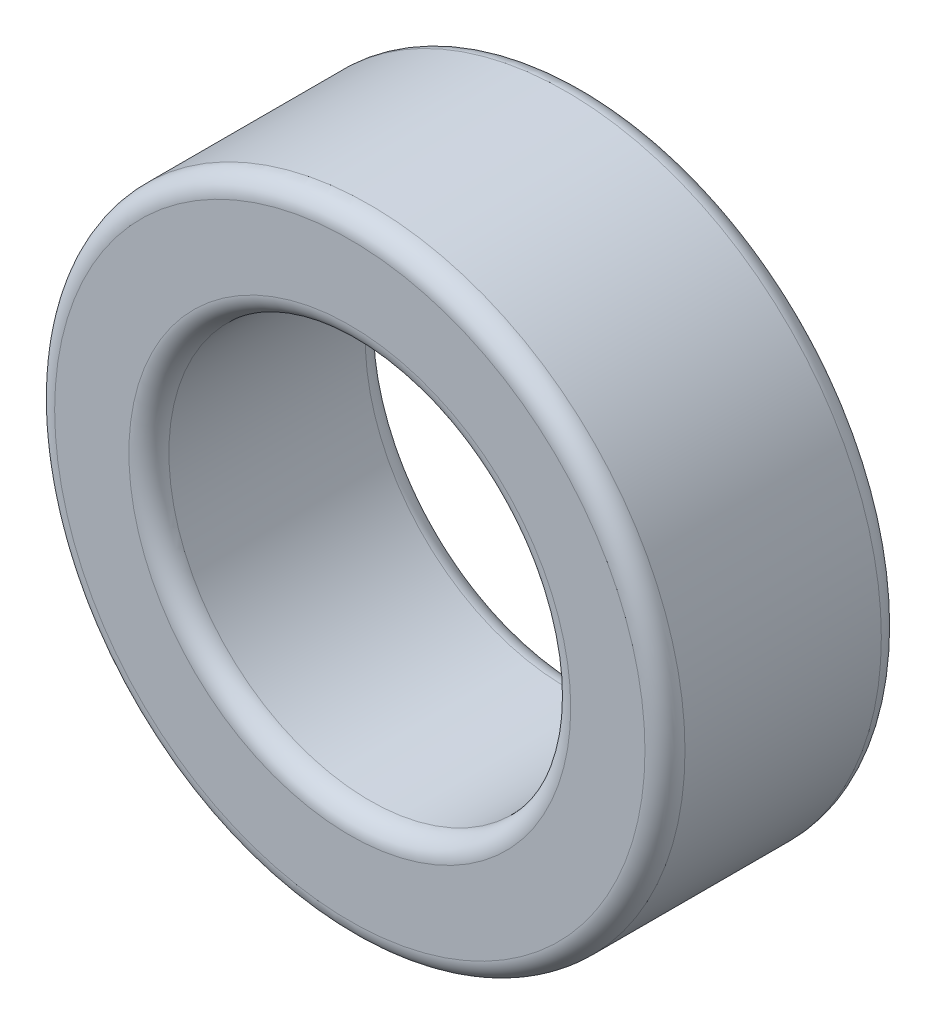
ISO-10303-21;
HEADER;
FILE_DESCRIPTION(('STEP AP214'),'2;1');
FILE_NAME('part.step','',(''),(''),'','','');
FILE_SCHEMA(('AUTOMOTIVE_DESIGN { 1 0 10303 214 1 1 1 1 }'));
ENDSEC;
DATA;
#1=APPLICATION_CONTEXT('core data for automotive mechanical design processes');
#2=APPLICATION_PROTOCOL_DEFINITION('international standard','automotive_design',2000,#1);
#3=PRODUCT_CONTEXT('',#1,'mechanical');
#4=PRODUCT('Part','Part','',(#3));
#5=PRODUCT_RELATED_PRODUCT_CATEGORY('part','',(#4));
#6=PRODUCT_DEFINITION_FORMATION('','',#4);
#7=PRODUCT_DEFINITION_CONTEXT('part definition',#1,'design');
#8=PRODUCT_DEFINITION('design','',#6,#7);
#9=PRODUCT_DEFINITION_SHAPE('','',#8);
#10=(LENGTH_UNIT() NAMED_UNIT(*) SI_UNIT(.MILLI.,.METRE.));
#11=(NAMED_UNIT(*) PLANE_ANGLE_UNIT() SI_UNIT($,.RADIAN.));
#12=(NAMED_UNIT(*) SI_UNIT($,.STERADIAN.) SOLID_ANGLE_UNIT());
#13=UNCERTAINTY_MEASURE_WITH_UNIT(LENGTH_MEASURE(1.E-05),#10,'distance_accuracy_value','');
#14=(GEOMETRIC_REPRESENTATION_CONTEXT(3) GLOBAL_UNCERTAINTY_ASSIGNED_CONTEXT((#13)) GLOBAL_UNIT_ASSIGNED_CONTEXT((#10,
#11,#12)) REPRESENTATION_CONTEXT('',''));
#15=CARTESIAN_POINT('',(0.,0.,0.));
#16=DIRECTION('',(0.,0.,1.));
#17=DIRECTION('',(1.,0.,0.));
#18=AXIS2_PLACEMENT_3D('',#15,#16,#17);
#19=CARTESIAN_POINT('',(0.,0.,1.5));
#20=DIRECTION('',(0.,0.,1.));
#21=DIRECTION('',(1.,0.,0.));
#22=AXIS2_PLACEMENT_3D('',#19,#20,#21);
#23=PLANE('',#22);
#24=CARTESIAN_POINT('',(0.,0.,1.5));
#25=DIRECTION('',(0.,0.,1.));
#26=DIRECTION('',(1.,0.,0.));
#27=AXIS2_PLACEMENT_3D('',#24,#25,#26);
#28=CIRCLE('',#27,2.804);
#29=CARTESIAN_POINT('',(2.804,0.,1.5));
#30=VERTEX_POINT('',#29);
#31=EDGE_CURVE('E10',#30,#30,#28,.F.);
#32=ORIENTED_EDGE('',*,*,#31,.T.);
#33=EDGE_LOOP('',(#32));
#34=FACE_BOUND('',#33,.T.);
#35=CARTESIAN_POINT('',(0.,0.,1.5));
#36=DIRECTION('',(0.,0.,1.));
#37=DIRECTION('',(1.,0.,0.));
#38=AXIS2_PLACEMENT_3D('',#35,#36,#37);
#39=CIRCLE('',#38,3.746);
#40=CARTESIAN_POINT('',(3.746,0.,1.5));
#41=VERTEX_POINT('',#40);
#42=EDGE_CURVE('E21',#41,#41,#39,.T.);
#43=ORIENTED_EDGE('',*,*,#42,.T.);
#44=EDGE_LOOP('',(#43));
#45=FACE_BOUND('',#44,.T.);
#46=ADVANCED_FACE('F14',(#34,#45),#23,.T.);
#47=CARTESIAN_POINT('',(0.,0.,-1.5));
#48=DIRECTION('',(0.,0.,1.));
#49=DIRECTION('',(1.,0.,0.));
#50=AXIS2_PLACEMENT_3D('',#47,#48,#49);
#51=PLANE('',#50);
#52=CARTESIAN_POINT('',(0.,0.,-1.5));
#53=DIRECTION('',(0.,0.,1.));
#54=DIRECTION('',(1.,0.,0.));
#55=AXIS2_PLACEMENT_3D('',#52,#53,#54);
#56=CIRCLE('',#55,2.804);
#57=CARTESIAN_POINT('',(2.804,0.,-1.5));
#58=VERTEX_POINT('',#57);
#59=EDGE_CURVE('E40',#58,#58,#56,.T.);
#60=ORIENTED_EDGE('',*,*,#59,.T.);
#61=EDGE_LOOP('',(#60));
#62=FACE_BOUND('',#61,.T.);
#63=CARTESIAN_POINT('',(0.,0.,-1.5));
#64=DIRECTION('',(0.,0.,1.));
#65=DIRECTION('',(1.,0.,0.));
#66=AXIS2_PLACEMENT_3D('',#63,#64,#65);
#67=CIRCLE('',#66,3.746);
#68=CARTESIAN_POINT('',(3.746,0.,-1.5));
#69=VERTEX_POINT('',#68);
#70=EDGE_CURVE('E43',#69,#69,#67,.F.);
#71=ORIENTED_EDGE('',*,*,#70,.T.);
#72=EDGE_LOOP('',(#71));
#73=FACE_BOUND('',#72,.T.);
#74=ADVANCED_FACE('F47',(#62,#73),#51,.F.);
#75=CARTESIAN_POINT('',(0.,0.,1.5));
#76=DIRECTION('',(0.,0.,-1.));
#77=DIRECTION('',(-1.,0.,0.));
#78=AXIS2_PLACEMENT_3D('',#75,#76,#77);
#79=CYLINDRICAL_SURFACE('',#78,4.);
#80=CARTESIAN_POINT('',(0.,0.,-1.246));
#81=DIRECTION('',(0.,0.,1.));
#82=DIRECTION('',(1.,0.,0.));
#83=AXIS2_PLACEMENT_3D('',#80,#81,#82);
#84=CIRCLE('',#83,4.);
#85=CARTESIAN_POINT('',(4.,0.,-1.246));
#86=VERTEX_POINT('',#85);
#87=EDGE_CURVE('E25',#86,#86,#84,.T.);
#88=ORIENTED_EDGE('',*,*,#87,.T.);
#89=EDGE_LOOP('',(#88));
#90=FACE_BOUND('',#89,.T.);
#91=CARTESIAN_POINT('',(0.,0.,1.246));
#92=DIRECTION('',(0.,0.,1.));
#93=DIRECTION('',(1.,0.,0.));
#94=AXIS2_PLACEMENT_3D('',#91,#92,#93);
#95=CIRCLE('',#94,4.);
#96=CARTESIAN_POINT('',(4.,0.,1.246));
#97=VERTEX_POINT('',#96);
#98=EDGE_CURVE('E29',#97,#97,#95,.F.);
#99=ORIENTED_EDGE('',*,*,#98,.T.);
#100=EDGE_LOOP('',(#99));
#101=FACE_BOUND('',#100,.T.);
#102=ADVANCED_FACE('F57',(#90,#101),#79,.T.);
#103=CARTESIAN_POINT('',(0.,0.,1.5));
#104=DIRECTION('',(0.,0.,-1.));
#105=DIRECTION('',(-1.,0.,0.));
#106=AXIS2_PLACEMENT_3D('',#103,#104,#105);
#107=CYLINDRICAL_SURFACE('',#106,2.55);
#108=CARTESIAN_POINT('',(0.,0.,-1.246));
#109=DIRECTION('',(0.,0.,1.));
#110=DIRECTION('',(1.,0.,0.));
#111=AXIS2_PLACEMENT_3D('',#108,#109,#110);
#112=CIRCLE('',#111,2.55);
#113=CARTESIAN_POINT('',(2.55,0.,-1.246));
#114=VERTEX_POINT('',#113);
#115=EDGE_CURVE('E34',#114,#114,#112,.F.);
#116=ORIENTED_EDGE('',*,*,#115,.T.);
#117=EDGE_LOOP('',(#116));
#118=FACE_BOUND('',#117,.T.);
#119=CARTESIAN_POINT('',(0.,0.,1.246));
#120=DIRECTION('',(0.,0.,1.));
#121=DIRECTION('',(1.,0.,0.));
#122=AXIS2_PLACEMENT_3D('',#119,#120,#121);
#123=CIRCLE('',#122,2.55);
#124=CARTESIAN_POINT('',(2.55,0.,1.246));
#125=VERTEX_POINT('',#124);
#126=EDGE_CURVE('E37',#125,#125,#123,.T.);
#127=ORIENTED_EDGE('',*,*,#126,.T.);
#128=EDGE_LOOP('',(#127));
#129=FACE_BOUND('',#128,.T.);
#130=ADVANCED_FACE('F60',(#118,#129),#107,.F.);
#131=CARTESIAN_POINT('',(0.,0.,-1.246));
#132=DIRECTION('',(0.,0.,1.));
#133=DIRECTION('',(1.,0.,0.));
#134=AXIS2_PLACEMENT_3D('',#131,#132,#133);
#135=TOROIDAL_SURFACE('',#134,2.804,0.254);
#136=ORIENTED_EDGE('',*,*,#115,.F.);
#137=EDGE_LOOP('',(#136));
#138=FACE_BOUND('',#137,.T.);
#139=ORIENTED_EDGE('',*,*,#59,.F.);
#140=EDGE_LOOP('',(#139));
#141=FACE_BOUND('',#140,.T.);
#142=ADVANCED_FACE('F53',(#138,#141),#135,.T.);
#143=CARTESIAN_POINT('',(0.,0.,-1.246));
#144=DIRECTION('',(0.,0.,1.));
#145=DIRECTION('',(1.,0.,0.));
#146=AXIS2_PLACEMENT_3D('',#143,#144,#145);
#147=TOROIDAL_SURFACE('',#146,3.746,0.254);
#148=ORIENTED_EDGE('',*,*,#70,.F.);
#149=EDGE_LOOP('',(#148));
#150=FACE_BOUND('',#149,.T.);
#151=ORIENTED_EDGE('',*,*,#87,.F.);
#152=EDGE_LOOP('',(#151));
#153=FACE_BOUND('',#152,.T.);
#154=ADVANCED_FACE('F49',(#150,#153),#147,.T.);
#155=CARTESIAN_POINT('',(0.,0.,1.246));
#156=DIRECTION('',(0.,0.,1.));
#157=DIRECTION('',(1.,0.,0.));
#158=AXIS2_PLACEMENT_3D('',#155,#156,#157);
#159=TOROIDAL_SURFACE('',#158,2.804,0.254);
#160=ORIENTED_EDGE('',*,*,#31,.F.);
#161=EDGE_LOOP('',(#160));
#162=FACE_BOUND('',#161,.T.);
#163=ORIENTED_EDGE('',*,*,#126,.F.);
#164=EDGE_LOOP('',(#163));
#165=FACE_BOUND('',#164,.T.);
#166=ADVANCED_FACE('F52',(#162,#165),#159,.T.);
#167=CARTESIAN_POINT('',(0.,0.,1.246));
#168=DIRECTION('',(0.,0.,1.));
#169=DIRECTION('',(1.,0.,0.));
#170=AXIS2_PLACEMENT_3D('',#167,#168,#169);
#171=TOROIDAL_SURFACE('',#170,3.746,0.254);
#172=ORIENTED_EDGE('',*,*,#98,.F.);
#173=EDGE_LOOP('',(#172));
#174=FACE_BOUND('',#173,.T.);
#175=ORIENTED_EDGE('',*,*,#42,.F.);
#176=EDGE_LOOP('',(#175));
#177=FACE_BOUND('',#176,.T.);
#178=ADVANCED_FACE('F16',(#174,#177),#171,.T.);
#179=CLOSED_SHELL('',(#46,#74,#102,#130,#142,#154,#166,#178));
#180=MANIFOLD_SOLID_BREP('B1',#179);
#181=ADVANCED_BREP_SHAPE_REPRESENTATION('',(#18,#180),#14);
#182=SHAPE_DEFINITION_REPRESENTATION(#9,#181);
ENDSEC;
END-ISO-10303-21;
